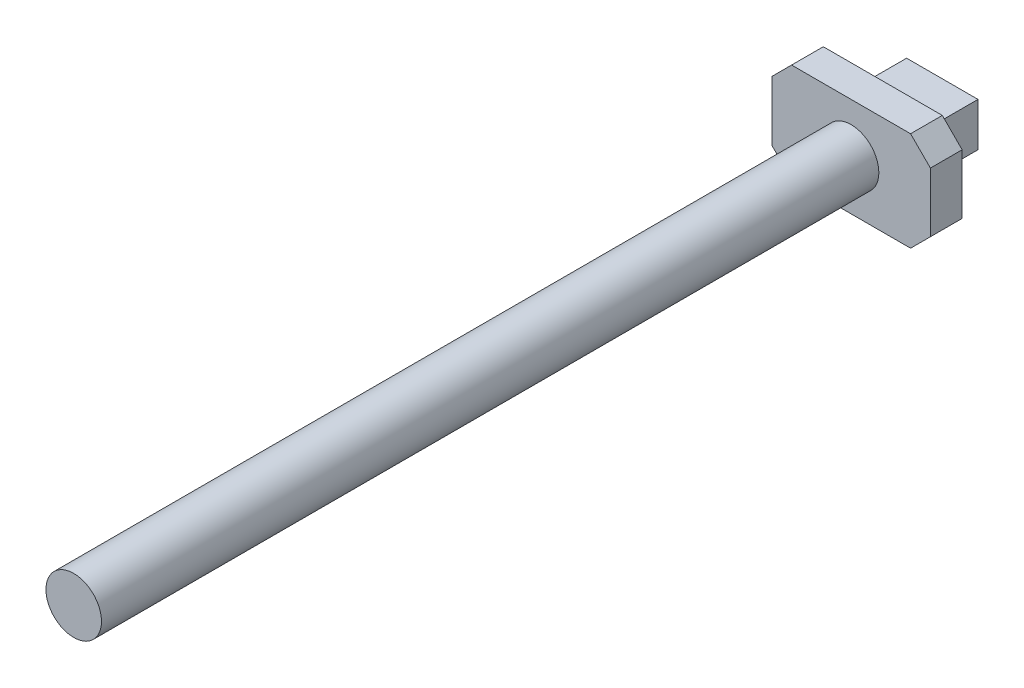
ISO-10303-21;
HEADER;
FILE_DESCRIPTION(('STEP AP214'),'2;1');
FILE_NAME('part.step','',(''),(''),'','','');
FILE_SCHEMA(('AUTOMOTIVE_DESIGN { 1 0 10303 214 1 1 1 1 }'));
ENDSEC;
DATA;
#1=APPLICATION_CONTEXT('core data for automotive mechanical design processes');
#2=APPLICATION_PROTOCOL_DEFINITION('international standard','automotive_design',2000,#1);
#3=PRODUCT_CONTEXT('',#1,'mechanical');
#4=PRODUCT('Part','Part','',(#3));
#5=PRODUCT_RELATED_PRODUCT_CATEGORY('part','',(#4));
#6=PRODUCT_DEFINITION_FORMATION('','',#4);
#7=PRODUCT_DEFINITION_CONTEXT('part definition',#1,'design');
#8=PRODUCT_DEFINITION('design','',#6,#7);
#9=PRODUCT_DEFINITION_SHAPE('','',#8);
#10=(LENGTH_UNIT() NAMED_UNIT(*) SI_UNIT(.MILLI.,.METRE.));
#11=(NAMED_UNIT(*) PLANE_ANGLE_UNIT() SI_UNIT($,.RADIAN.));
#12=(NAMED_UNIT(*) SI_UNIT($,.STERADIAN.) SOLID_ANGLE_UNIT());
#13=UNCERTAINTY_MEASURE_WITH_UNIT(LENGTH_MEASURE(1.E-05),#10,'distance_accuracy_value','');
#14=(GEOMETRIC_REPRESENTATION_CONTEXT(3) GLOBAL_UNCERTAINTY_ASSIGNED_CONTEXT((#13)) GLOBAL_UNIT_ASSIGNED_CONTEXT((#10,
#11,#12)) REPRESENTATION_CONTEXT('',''));
#15=CARTESIAN_POINT('',(0.,0.,0.));
#16=DIRECTION('',(0.,0.,1.));
#17=DIRECTION('',(1.,0.,0.));
#18=AXIS2_PLACEMENT_3D('',#15,#16,#17);
#19=CARTESIAN_POINT('',(-36.8309975325847,0.,-44.));
#20=DIRECTION('',(0.,0.,-1.));
#21=DIRECTION('',(-1.,0.,0.));
#22=AXIS2_PLACEMENT_3D('',#19,#20,#21);
#23=PLANE('',#22);
#24=DIRECTION('',(-1.,0.,0.));
#25=VECTOR('',#24,1.);
#26=CARTESIAN_POINT('',(-36.8309975325847,-12.5,-44.));
#27=LINE('',#26,#25);
#28=CARTESIAN_POINT('',(15.,-12.5,-44.));
#29=VERTEX_POINT('',#28);
#30=CARTESIAN_POINT('',(-15.,-12.5,-44.));
#31=VERTEX_POINT('',#30);
#32=EDGE_CURVE('E163',#29,#31,#27,.T.);
#33=ORIENTED_EDGE('',*,*,#32,.T.);
#34=DIRECTION('',(-0.707106781186548,0.707106781186548,0.));
#35=VECTOR('',#34,1.);
#36=CARTESIAN_POINT('',(-32.1654987662924,4.66549876629236,-44.));
#37=LINE('',#36,#35);
#38=CARTESIAN_POINT('',(-20.,-7.50000000000001,-44.));
#39=VERTEX_POINT('',#38);
#40=EDGE_CURVE('E99',#31,#39,#37,.T.);
#41=ORIENTED_EDGE('',*,*,#40,.T.);
#42=DIRECTION('',(0.,-1.,0.));
#43=VECTOR('',#42,1.);
#44=CARTESIAN_POINT('',(-20.,0.,-44.));
#45=LINE('',#44,#43);
#46=CARTESIAN_POINT('',(-20.,7.5,-44.));
#47=VERTEX_POINT('',#46);
#48=EDGE_CURVE('E269',#47,#39,#45,.T.);
#49=ORIENTED_EDGE('',*,*,#48,.F.);
#50=DIRECTION('',(-0.707106781186548,-0.707106781186548,0.));
#51=VECTOR('',#50,1.);
#52=CARTESIAN_POINT('',(-32.1654987662924,-4.66549876629236,-44.));
#53=LINE('',#52,#51);
#54=CARTESIAN_POINT('',(-15.,12.5,-44.));
#55=VERTEX_POINT('',#54);
#56=EDGE_CURVE('E272',#55,#47,#53,.T.);
#57=ORIENTED_EDGE('',*,*,#56,.F.);
#58=DIRECTION('',(-1.,0.,0.));
#59=VECTOR('',#58,1.);
#60=CARTESIAN_POINT('',(-36.8309975325847,12.5,-44.));
#61=LINE('',#60,#59);
#62=CARTESIAN_POINT('',(15.,12.5,-44.));
#63=VERTEX_POINT('',#62);
#64=EDGE_CURVE('E124',#63,#55,#61,.T.);
#65=ORIENTED_EDGE('',*,*,#64,.F.);
#66=DIRECTION('',(0.707106781186548,-0.707106781186548,0.));
#67=VECTOR('',#66,1.);
#68=CARTESIAN_POINT('',(-4.66549876629236,32.1654987662924,-44.));
#69=LINE('',#68,#67);
#70=CARTESIAN_POINT('',(20.,7.49999999999999,-44.));
#71=VERTEX_POINT('',#70);
#72=EDGE_CURVE('E116',#63,#71,#69,.T.);
#73=ORIENTED_EDGE('',*,*,#72,.T.);
#74=DIRECTION('',(0.,-1.,0.));
#75=VECTOR('',#74,1.);
#76=CARTESIAN_POINT('',(20.,0.,-44.));
#77=LINE('',#76,#75);
#78=CARTESIAN_POINT('',(20.,-7.5,-44.));
#79=VERTEX_POINT('',#78);
#80=EDGE_CURVE('E120',#71,#79,#77,.T.);
#81=ORIENTED_EDGE('',*,*,#80,.T.);
#82=DIRECTION('',(-0.707106781186548,-0.707106781186548,0.));
#83=VECTOR('',#82,1.);
#84=CARTESIAN_POINT('',(-4.66549876629235,-32.1654987662924,-44.));
#85=LINE('',#84,#83);
#86=EDGE_CURVE('E57',#79,#29,#85,.T.);
#87=ORIENTED_EDGE('',*,*,#86,.T.);
#88=EDGE_LOOP('',(#33,#41,#49,#57,#65,#73,#81,#87));
#89=FACE_BOUND('',#88,.T.);
#90=DIRECTION('',(-1.,0.,0.));
#91=VECTOR('',#90,1.);
#92=CARTESIAN_POINT('',(-9.,-5.5,-44.));
#93=LINE('',#92,#91);
#94=CARTESIAN_POINT('',(9.,-5.5,-44.));
#95=VERTEX_POINT('',#94);
#96=CARTESIAN_POINT('',(-9.,-5.5,-44.));
#97=VERTEX_POINT('',#96);
#98=EDGE_CURVE('E246',#95,#97,#93,.T.);
#99=ORIENTED_EDGE('',*,*,#98,.F.);
#100=DIRECTION('',(0.,-1.,0.));
#101=VECTOR('',#100,1.);
#102=CARTESIAN_POINT('',(9.,5.5,-44.));
#103=LINE('',#102,#101);
#104=CARTESIAN_POINT('',(9.,5.5,-44.));
#105=VERTEX_POINT('',#104);
#106=EDGE_CURVE('E255',#105,#95,#103,.T.);
#107=ORIENTED_EDGE('',*,*,#106,.F.);
#108=DIRECTION('',(1.,0.,0.));
#109=VECTOR('',#108,1.);
#110=CARTESIAN_POINT('',(-9.,5.5,-44.));
#111=LINE('',#110,#109);
#112=CARTESIAN_POINT('',(-8.99999999999999,5.5,-44.));
#113=VERTEX_POINT('',#112);
#114=EDGE_CURVE('E261',#113,#105,#111,.T.);
#115=ORIENTED_EDGE('',*,*,#114,.F.);
#116=DIRECTION('',(0.,1.,0.));
#117=VECTOR('',#116,1.);
#118=CARTESIAN_POINT('',(-9.,5.5,-44.));
#119=LINE('',#118,#117);
#120=EDGE_CURVE('E259',#97,#113,#119,.T.);
#121=ORIENTED_EDGE('',*,*,#120,.F.);
#122=EDGE_LOOP('',(#99,#107,#115,#121));
#123=FACE_BOUND('',#122,.T.);
#124=ADVANCED_FACE('F33',(#89,#123),#23,.T.);
#125=CARTESIAN_POINT('',(0.,0.,-36.));
#126=DIRECTION('',(0.,0.,1.));
#127=DIRECTION('',(1.,0.,0.));
#128=AXIS2_PLACEMENT_3D('',#125,#126,#127);
#129=CYLINDRICAL_SURFACE('',#128,7.);
#130=CARTESIAN_POINT('',(0.,0.,-36.));
#131=DIRECTION('',(0.,0.,-1.));
#132=DIRECTION('',(-1.,0.,0.));
#133=AXIS2_PLACEMENT_3D('',#130,#131,#132);
#134=CIRCLE('',#133,7.);
#135=CARTESIAN_POINT('',(-7.,0.,-36.));
#136=VERTEX_POINT('',#135);
#137=EDGE_CURVE('E41',#136,#136,#134,.F.);
#138=ORIENTED_EDGE('',*,*,#137,.T.);
#139=EDGE_LOOP('',(#138));
#140=FACE_BOUND('',#139,.T.);
#141=CARTESIAN_POINT('',(0.,0.,160.));
#142=DIRECTION('',(0.,0.,1.));
#143=DIRECTION('',(1.,0.,0.));
#144=AXIS2_PLACEMENT_3D('',#141,#142,#143);
#145=CIRCLE('',#144,7.);
#146=CARTESIAN_POINT('',(7.,0.,160.));
#147=VERTEX_POINT('',#146);
#148=EDGE_CURVE('E11',#147,#147,#145,.T.);
#149=ORIENTED_EDGE('',*,*,#148,.F.);
#150=EDGE_LOOP('',(#149));
#151=FACE_BOUND('',#150,.T.);
#152=ADVANCED_FACE('F35',(#140,#151),#129,.T.);
#153=CARTESIAN_POINT('',(0.,0.,160.));
#154=DIRECTION('',(0.,0.,1.));
#155=DIRECTION('',(1.,0.,0.));
#156=AXIS2_PLACEMENT_3D('',#153,#154,#155);
#157=PLANE('',#156);
#158=ORIENTED_EDGE('',*,*,#148,.T.);
#159=EDGE_LOOP('',(#158));
#160=FACE_BOUND('',#159,.T.);
#161=ADVANCED_FACE('F201',(#160),#157,.T.);
#162=CARTESIAN_POINT('',(-36.8309975325847,-12.5,-44.));
#163=DIRECTION('',(0.,1.,0.));
#164=DIRECTION('',(0.,0.,1.));
#165=AXIS2_PLACEMENT_3D('',#162,#163,#164);
#166=PLANE('',#165);
#167=DIRECTION('',(-1.,0.,0.));
#168=VECTOR('',#167,1.);
#169=CARTESIAN_POINT('',(-36.8309975325847,-12.5,-36.));
#170=LINE('',#169,#168);
#171=CARTESIAN_POINT('',(15.,-12.5,-36.));
#172=VERTEX_POINT('',#171);
#173=CARTESIAN_POINT('',(-15.,-12.5,-36.));
#174=VERTEX_POINT('',#173);
#175=EDGE_CURVE('E143',#172,#174,#170,.T.);
#176=ORIENTED_EDGE('',*,*,#175,.T.);
#177=DIRECTION('',(0.,0.,1.));
#178=VECTOR('',#177,1.);
#179=CARTESIAN_POINT('',(-15.,-12.5,-44.));
#180=LINE('',#179,#178);
#181=EDGE_CURVE('E173',#31,#174,#180,.T.);
#182=ORIENTED_EDGE('',*,*,#181,.F.);
#183=ORIENTED_EDGE('',*,*,#32,.F.);
#184=DIRECTION('',(0.,0.,1.));
#185=VECTOR('',#184,1.);
#186=CARTESIAN_POINT('',(15.,-12.5,-44.));
#187=LINE('',#186,#185);
#188=EDGE_CURVE('E139',#29,#172,#187,.T.);
#189=ORIENTED_EDGE('',*,*,#188,.T.);
#190=EDGE_LOOP('',(#176,#182,#183,#189));
#191=FACE_BOUND('',#190,.T.);
#192=ADVANCED_FACE('F188',(#191),#166,.F.);
#193=CARTESIAN_POINT('',(-32.1654987662924,4.66549876629236,-44.));
#194=DIRECTION('',(0.707106781186547,0.707106781186547,0.));
#195=DIRECTION('',(-0.707106781186548,0.707106781186548,0.));
#196=AXIS2_PLACEMENT_3D('',#193,#194,#195);
#197=PLANE('',#196);
#198=DIRECTION('',(-0.707106781186548,0.707106781186548,0.));
#199=VECTOR('',#198,1.);
#200=CARTESIAN_POINT('',(-32.1654987662924,4.66549876629236,-36.));
#201=LINE('',#200,#199);
#202=CARTESIAN_POINT('',(-20.,-7.50000000000001,-36.));
#203=VERTEX_POINT('',#202);
#204=EDGE_CURVE('E146',#174,#203,#201,.T.);
#205=ORIENTED_EDGE('',*,*,#204,.T.);
#206=DIRECTION('',(0.,0.,1.));
#207=VECTOR('',#206,1.);
#208=CARTESIAN_POINT('',(-20.,-7.50000000000001,-44.));
#209=LINE('',#208,#207);
#210=EDGE_CURVE('E171',#39,#203,#209,.T.);
#211=ORIENTED_EDGE('',*,*,#210,.F.);
#212=ORIENTED_EDGE('',*,*,#40,.F.);
#213=ORIENTED_EDGE('',*,*,#181,.T.);
#214=EDGE_LOOP('',(#205,#211,#212,#213));
#215=FACE_BOUND('',#214,.T.);
#216=ADVANCED_FACE('F284',(#215),#197,.F.);
#217=CARTESIAN_POINT('',(-20.,0.,-44.));
#218=DIRECTION('',(-1.,0.,0.));
#219=DIRECTION('',(0.,0.,1.));
#220=AXIS2_PLACEMENT_3D('',#217,#218,#219);
#221=PLANE('',#220);
#222=DIRECTION('',(0.,-1.,0.));
#223=VECTOR('',#222,1.);
#224=CARTESIAN_POINT('',(-20.,0.,-36.));
#225=LINE('',#224,#223);
#226=CARTESIAN_POINT('',(-20.,7.5,-36.));
#227=VERTEX_POINT('',#226);
#228=EDGE_CURVE('E150',#227,#203,#225,.T.);
#229=ORIENTED_EDGE('',*,*,#228,.F.);
#230=DIRECTION('',(0.,0.,1.));
#231=VECTOR('',#230,1.);
#232=CARTESIAN_POINT('',(-20.,7.5,-44.));
#233=LINE('',#232,#231);
#234=EDGE_CURVE('E169',#47,#227,#233,.T.);
#235=ORIENTED_EDGE('',*,*,#234,.F.);
#236=ORIENTED_EDGE('',*,*,#48,.T.);
#237=ORIENTED_EDGE('',*,*,#210,.T.);
#238=EDGE_LOOP('',(#229,#235,#236,#237));
#239=FACE_BOUND('',#238,.T.);
#240=ADVANCED_FACE('F283',(#239),#221,.T.);
#241=CARTESIAN_POINT('',(-32.1654987662924,-4.66549876629236,-44.));
#242=DIRECTION('',(-0.707106781186547,0.707106781186547,0.));
#243=DIRECTION('',(-0.707106781186548,-0.707106781186548,0.));
#244=AXIS2_PLACEMENT_3D('',#241,#242,#243);
#245=PLANE('',#244);
#246=DIRECTION('',(-0.707106781186548,-0.707106781186548,0.));
#247=VECTOR('',#246,1.);
#248=CARTESIAN_POINT('',(-32.1654987662924,-4.66549876629236,-36.));
#249=LINE('',#248,#247);
#250=CARTESIAN_POINT('',(-15.,12.5,-36.));
#251=VERTEX_POINT('',#250);
#252=EDGE_CURVE('E153',#251,#227,#249,.T.);
#253=ORIENTED_EDGE('',*,*,#252,.F.);
#254=DIRECTION('',(0.,0.,1.));
#255=VECTOR('',#254,1.);
#256=CARTESIAN_POINT('',(-15.,12.5,-44.));
#257=LINE('',#256,#255);
#258=EDGE_CURVE('E167',#55,#251,#257,.T.);
#259=ORIENTED_EDGE('',*,*,#258,.F.);
#260=ORIENTED_EDGE('',*,*,#56,.T.);
#261=ORIENTED_EDGE('',*,*,#234,.T.);
#262=EDGE_LOOP('',(#253,#259,#260,#261));
#263=FACE_BOUND('',#262,.T.);
#264=ADVANCED_FACE('F280',(#263),#245,.T.);
#265=CARTESIAN_POINT('',(-36.8309975325847,12.5,-44.));
#266=DIRECTION('',(0.,1.,0.));
#267=DIRECTION('',(0.,0.,1.));
#268=AXIS2_PLACEMENT_3D('',#265,#266,#267);
#269=PLANE('',#268);
#270=DIRECTION('',(-1.,0.,0.));
#271=VECTOR('',#270,1.);
#272=CARTESIAN_POINT('',(-36.8309975325847,12.5,-36.));
#273=LINE('',#272,#271);
#274=CARTESIAN_POINT('',(15.,12.5,-36.));
#275=VERTEX_POINT('',#274);
#276=EDGE_CURVE('E156',#275,#251,#273,.T.);
#277=ORIENTED_EDGE('',*,*,#276,.F.);
#278=DIRECTION('',(0.,0.,1.));
#279=VECTOR('',#278,1.);
#280=CARTESIAN_POINT('',(15.,12.5,-44.));
#281=LINE('',#280,#279);
#282=EDGE_CURVE('E134',#63,#275,#281,.T.);
#283=ORIENTED_EDGE('',*,*,#282,.F.);
#284=ORIENTED_EDGE('',*,*,#64,.T.);
#285=ORIENTED_EDGE('',*,*,#258,.T.);
#286=EDGE_LOOP('',(#277,#283,#284,#285));
#287=FACE_BOUND('',#286,.T.);
#288=ADVANCED_FACE('F276',(#287),#269,.T.);
#289=CARTESIAN_POINT('',(-4.66549876629236,32.1654987662924,-44.));
#290=DIRECTION('',(-0.707106781186547,-0.707106781186547,0.));
#291=DIRECTION('',(0.707106781186548,-0.707106781186548,0.));
#292=AXIS2_PLACEMENT_3D('',#289,#290,#291);
#293=PLANE('',#292);
#294=DIRECTION('',(0.707106781186548,-0.707106781186548,0.));
#295=VECTOR('',#294,1.);
#296=CARTESIAN_POINT('',(-4.66549876629236,32.1654987662924,-36.));
#297=LINE('',#296,#295);
#298=CARTESIAN_POINT('',(20.,7.49999999999999,-36.));
#299=VERTEX_POINT('',#298);
#300=EDGE_CURVE('E131',#275,#299,#297,.T.);
#301=ORIENTED_EDGE('',*,*,#300,.T.);
#302=DIRECTION('',(0.,0.,1.));
#303=VECTOR('',#302,1.);
#304=CARTESIAN_POINT('',(20.,7.49999999999999,-44.));
#305=LINE('',#304,#303);
#306=EDGE_CURVE('E128',#71,#299,#305,.T.);
#307=ORIENTED_EDGE('',*,*,#306,.F.);
#308=ORIENTED_EDGE('',*,*,#72,.F.);
#309=ORIENTED_EDGE('',*,*,#282,.T.);
#310=EDGE_LOOP('',(#301,#307,#308,#309));
#311=FACE_BOUND('',#310,.T.);
#312=ADVANCED_FACE('F129',(#311),#293,.F.);
#313=CARTESIAN_POINT('',(20.,0.,-44.));
#314=DIRECTION('',(-1.,0.,0.));
#315=DIRECTION('',(0.,0.,1.));
#316=AXIS2_PLACEMENT_3D('',#313,#314,#315);
#317=PLANE('',#316);
#318=DIRECTION('',(0.,-1.,0.));
#319=VECTOR('',#318,1.);
#320=CARTESIAN_POINT('',(20.,0.,-36.));
#321=LINE('',#320,#319);
#322=CARTESIAN_POINT('',(20.,-7.5,-36.));
#323=VERTEX_POINT('',#322);
#324=EDGE_CURVE('E160',#299,#323,#321,.T.);
#325=ORIENTED_EDGE('',*,*,#324,.T.);
#326=DIRECTION('',(0.,0.,1.));
#327=VECTOR('',#326,1.);
#328=CARTESIAN_POINT('',(20.,-7.5,-44.));
#329=LINE('',#328,#327);
#330=EDGE_CURVE('E135',#79,#323,#329,.T.);
#331=ORIENTED_EDGE('',*,*,#330,.F.);
#332=ORIENTED_EDGE('',*,*,#80,.F.);
#333=ORIENTED_EDGE('',*,*,#306,.T.);
#334=EDGE_LOOP('',(#325,#331,#332,#333));
#335=FACE_BOUND('',#334,.T.);
#336=ADVANCED_FACE('F137',(#335),#317,.F.);
#337=CARTESIAN_POINT('',(-4.66549876629235,-32.1654987662924,-44.));
#338=DIRECTION('',(-0.707106781186547,0.707106781186547,0.));
#339=DIRECTION('',(-0.707106781186548,-0.707106781186548,0.));
#340=AXIS2_PLACEMENT_3D('',#337,#338,#339);
#341=PLANE('',#340);
#342=DIRECTION('',(-0.707106781186548,-0.707106781186548,0.));
#343=VECTOR('',#342,1.);
#344=CARTESIAN_POINT('',(-4.66549876629235,-32.1654987662924,-36.));
#345=LINE('',#344,#343);
#346=EDGE_CURVE('E90',#323,#172,#345,.T.);
#347=ORIENTED_EDGE('',*,*,#346,.T.);
#348=ORIENTED_EDGE('',*,*,#188,.F.);
#349=ORIENTED_EDGE('',*,*,#86,.F.);
#350=ORIENTED_EDGE('',*,*,#330,.T.);
#351=EDGE_LOOP('',(#347,#348,#349,#350));
#352=FACE_BOUND('',#351,.T.);
#353=ADVANCED_FACE('F183',(#352),#341,.F.);
#354=CARTESIAN_POINT('',(-36.8309975325847,0.,-36.));
#355=DIRECTION('',(0.,0.,-1.));
#356=DIRECTION('',(-1.,0.,0.));
#357=AXIS2_PLACEMENT_3D('',#354,#355,#356);
#358=PLANE('',#357);
#359=ORIENTED_EDGE('',*,*,#137,.F.);
#360=EDGE_LOOP('',(#359));
#361=FACE_BOUND('',#360,.T.);
#362=ORIENTED_EDGE('',*,*,#175,.F.);
#363=ORIENTED_EDGE('',*,*,#346,.F.);
#364=ORIENTED_EDGE('',*,*,#324,.F.);
#365=ORIENTED_EDGE('',*,*,#300,.F.);
#366=ORIENTED_EDGE('',*,*,#276,.T.);
#367=ORIENTED_EDGE('',*,*,#252,.T.);
#368=ORIENTED_EDGE('',*,*,#228,.T.);
#369=ORIENTED_EDGE('',*,*,#204,.F.);
#370=EDGE_LOOP('',(#362,#363,#364,#365,#366,#367,#368,#369));
#371=FACE_BOUND('',#370,.T.);
#372=ADVANCED_FACE('F179',(#361,#371),#358,.F.);
#373=CARTESIAN_POINT('',(9.,5.5,-59.));
#374=DIRECTION('',(-1.,0.,0.));
#375=DIRECTION('',(0.,0.,1.));
#376=AXIS2_PLACEMENT_3D('',#373,#374,#375);
#377=PLANE('',#376);
#378=ORIENTED_EDGE('',*,*,#106,.T.);
#379=DIRECTION('',(0.,0.,1.));
#380=VECTOR('',#379,1.);
#381=CARTESIAN_POINT('',(9.,-5.5,-59.));
#382=LINE('',#381,#380);
#383=CARTESIAN_POINT('',(9.,-5.5,-59.));
#384=VERTEX_POINT('',#383);
#385=EDGE_CURVE('E147',#384,#95,#382,.T.);
#386=ORIENTED_EDGE('',*,*,#385,.F.);
#387=DIRECTION('',(0.,-1.,0.));
#388=VECTOR('',#387,1.);
#389=CARTESIAN_POINT('',(9.,5.5,-59.));
#390=LINE('',#389,#388);
#391=CARTESIAN_POINT('',(9.,5.5,-59.));
#392=VERTEX_POINT('',#391);
#393=EDGE_CURVE('E235',#392,#384,#390,.T.);
#394=ORIENTED_EDGE('',*,*,#393,.F.);
#395=DIRECTION('',(0.,0.,1.));
#396=VECTOR('',#395,1.);
#397=CARTESIAN_POINT('',(9.,5.5,-59.));
#398=LINE('',#397,#396);
#399=EDGE_CURVE('E251',#392,#105,#398,.T.);
#400=ORIENTED_EDGE('',*,*,#399,.T.);
#401=EDGE_LOOP('',(#378,#386,#394,#400));
#402=FACE_BOUND('',#401,.T.);
#403=ADVANCED_FACE('F182',(#402),#377,.F.);
#404=CARTESIAN_POINT('',(-9.,-5.5,-59.));
#405=DIRECTION('',(0.,1.,0.));
#406=DIRECTION('',(-1.,0.,0.));
#407=AXIS2_PLACEMENT_3D('',#404,#405,#406);
#408=PLANE('',#407);
#409=ORIENTED_EDGE('',*,*,#98,.T.);
#410=DIRECTION('',(0.,0.,1.));
#411=VECTOR('',#410,1.);
#412=CARTESIAN_POINT('',(-9.,-5.5,-59.));
#413=LINE('',#412,#411);
#414=CARTESIAN_POINT('',(-9.,-5.5,-59.));
#415=VERTEX_POINT('',#414);
#416=EDGE_CURVE('E243',#415,#97,#413,.T.);
#417=ORIENTED_EDGE('',*,*,#416,.F.);
#418=DIRECTION('',(-1.,0.,0.));
#419=VECTOR('',#418,1.);
#420=CARTESIAN_POINT('',(-9.,-5.5,-59.));
#421=LINE('',#420,#419);
#422=EDGE_CURVE('E228',#384,#415,#421,.T.);
#423=ORIENTED_EDGE('',*,*,#422,.F.);
#424=ORIENTED_EDGE('',*,*,#385,.T.);
#425=EDGE_LOOP('',(#409,#417,#423,#424));
#426=FACE_BOUND('',#425,.T.);
#427=ADVANCED_FACE('F205',(#426),#408,.F.);
#428=CARTESIAN_POINT('',(-9.,5.5,-59.));
#429=DIRECTION('',(1.,0.,0.));
#430=DIRECTION('',(0.,1.,0.));
#431=AXIS2_PLACEMENT_3D('',#428,#429,#430);
#432=PLANE('',#431);
#433=ORIENTED_EDGE('',*,*,#120,.T.);
#434=DIRECTION('',(0.,0.,1.));
#435=VECTOR('',#434,1.);
#436=CARTESIAN_POINT('',(-9.,5.5,-59.));
#437=LINE('',#436,#435);
#438=CARTESIAN_POINT('',(-9.,5.5,-59.));
#439=VERTEX_POINT('',#438);
#440=EDGE_CURVE('E48',#439,#113,#437,.T.);
#441=ORIENTED_EDGE('',*,*,#440,.F.);
#442=DIRECTION('',(0.,1.,0.));
#443=VECTOR('',#442,1.);
#444=CARTESIAN_POINT('',(-9.,5.5,-59.));
#445=LINE('',#444,#443);
#446=EDGE_CURVE('E232',#415,#439,#445,.T.);
#447=ORIENTED_EDGE('',*,*,#446,.F.);
#448=ORIENTED_EDGE('',*,*,#416,.T.);
#449=EDGE_LOOP('',(#433,#441,#447,#448));
#450=FACE_BOUND('',#449,.T.);
#451=ADVANCED_FACE('F209',(#450),#432,.F.);
#452=CARTESIAN_POINT('',(-9.,5.5,-59.));
#453=DIRECTION('',(0.,-1.,0.));
#454=DIRECTION('',(1.,0.,0.));
#455=AXIS2_PLACEMENT_3D('',#452,#453,#454);
#456=PLANE('',#455);
#457=ORIENTED_EDGE('',*,*,#114,.T.);
#458=ORIENTED_EDGE('',*,*,#399,.F.);
#459=DIRECTION('',(1.,0.,0.));
#460=VECTOR('',#459,1.);
#461=CARTESIAN_POINT('',(-9.,5.5,-59.));
#462=LINE('',#461,#460);
#463=EDGE_CURVE('E249',#439,#392,#462,.T.);
#464=ORIENTED_EDGE('',*,*,#463,.F.);
#465=ORIENTED_EDGE('',*,*,#440,.T.);
#466=EDGE_LOOP('',(#457,#458,#464,#465));
#467=FACE_BOUND('',#466,.T.);
#468=ADVANCED_FACE('F213',(#467),#456,.F.);
#469=CARTESIAN_POINT('',(59.2019250848637,-47.5923770963504,-59.));
#470=DIRECTION('',(0.,0.,1.));
#471=DIRECTION('',(1.,0.,0.));
#472=AXIS2_PLACEMENT_3D('',#469,#470,#471);
#473=PLANE('',#472);
#474=ORIENTED_EDGE('',*,*,#422,.T.);
#475=ORIENTED_EDGE('',*,*,#446,.T.);
#476=ORIENTED_EDGE('',*,*,#463,.T.);
#477=ORIENTED_EDGE('',*,*,#393,.T.);
#478=EDGE_LOOP('',(#474,#475,#476,#477));
#479=FACE_BOUND('',#478,.T.);
#480=ADVANCED_FACE('F217',(#479),#473,.F.);
#481=CLOSED_SHELL('',(#124,#152,#161,#192,#216,#240,#264,#288,#312,#336,#353,#372,#403,#427,
#451,#468,#480));
#482=MANIFOLD_SOLID_BREP('B2',#481);
#483=ADVANCED_BREP_SHAPE_REPRESENTATION('',(#18,#482),#14);
#484=SHAPE_DEFINITION_REPRESENTATION(#9,#483);
ENDSEC;
END-ISO-10303-21;
